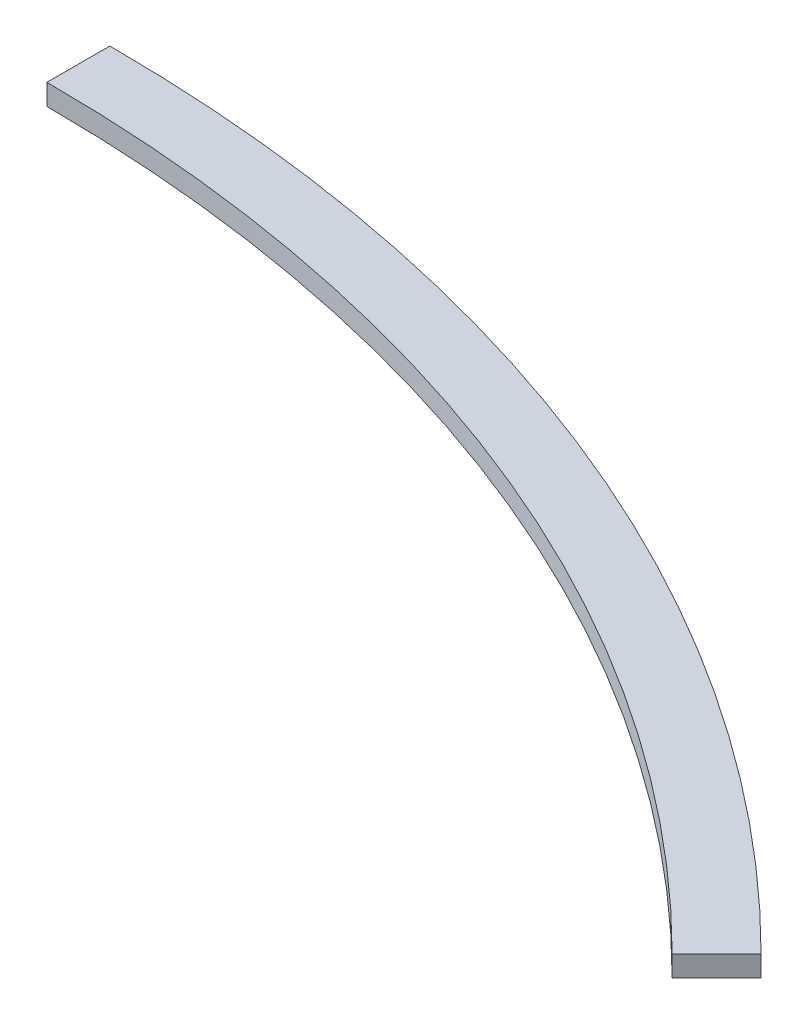
ISO-10303-21;
HEADER;
FILE_DESCRIPTION(('STEP AP214'),'2;1');
FILE_NAME('part.step','',(''),(''),'','','');
FILE_SCHEMA(('AUTOMOTIVE_DESIGN { 1 0 10303 214 1 1 1 1 }'));
ENDSEC;
DATA;
#1=APPLICATION_CONTEXT('core data for automotive mechanical design processes');
#2=APPLICATION_PROTOCOL_DEFINITION('international standard','automotive_design',2000,#1);
#3=PRODUCT_CONTEXT('',#1,'mechanical');
#4=PRODUCT('Part','Part','',(#3));
#5=PRODUCT_RELATED_PRODUCT_CATEGORY('part','',(#4));
#6=PRODUCT_DEFINITION_FORMATION('','',#4);
#7=PRODUCT_DEFINITION_CONTEXT('part definition',#1,'design');
#8=PRODUCT_DEFINITION('design','',#6,#7);
#9=PRODUCT_DEFINITION_SHAPE('','',#8);
#10=(LENGTH_UNIT() NAMED_UNIT(*) SI_UNIT(.MILLI.,.METRE.));
#11=(NAMED_UNIT(*) PLANE_ANGLE_UNIT() SI_UNIT($,.RADIAN.));
#12=(NAMED_UNIT(*) SI_UNIT($,.STERADIAN.) SOLID_ANGLE_UNIT());
#13=UNCERTAINTY_MEASURE_WITH_UNIT(LENGTH_MEASURE(1.E-05),#10,'distance_accuracy_value','');
#14=(GEOMETRIC_REPRESENTATION_CONTEXT(3) GLOBAL_UNCERTAINTY_ASSIGNED_CONTEXT((#13)) GLOBAL_UNIT_ASSIGNED_CONTEXT((#10,
#11,#12)) REPRESENTATION_CONTEXT('',''));
#15=CARTESIAN_POINT('',(0.,0.,0.));
#16=DIRECTION('',(0.,0.,1.));
#17=DIRECTION('',(1.,0.,0.));
#18=AXIS2_PLACEMENT_3D('',#15,#16,#17);
#19=CARTESIAN_POINT('',(0.,10.,0.));
#20=DIRECTION('',(0.,-1.,0.));
#21=DIRECTION('',(0.,0.,-1.));
#22=AXIS2_PLACEMENT_3D('',#19,#20,#21);
#23=CYLINDRICAL_SURFACE('',#22,720.);
#24=CARTESIAN_POINT('',(0.,0.,0.));
#25=DIRECTION('',(0.,-1.,0.));
#26=DIRECTION('',(0.,0.,-1.));
#27=AXIS2_PLACEMENT_3D('',#24,#25,#26);
#28=CIRCLE('',#27,720.);
#29=CARTESIAN_POINT('',(0.,0.,-720.));
#30=VERTEX_POINT('',#29);
#31=CARTESIAN_POINT('',(509.116882454315,0.,-509.116882454313));
#32=VERTEX_POINT('',#31);
#33=EDGE_CURVE('E97',#30,#32,#28,.T.);
#34=ORIENTED_EDGE('',*,*,#33,.T.);
#35=DIRECTION('',(0.,-1.,0.));
#36=VECTOR('',#35,1.);
#37=CARTESIAN_POINT('',(509.116882454315,10.,-509.116882454313));
#38=LINE('',#37,#36);
#39=CARTESIAN_POINT('',(509.116882454315,10.,-509.116882454313));
#40=VERTEX_POINT('',#39);
#41=EDGE_CURVE('E11',#40,#32,#38,.T.);
#42=ORIENTED_EDGE('',*,*,#41,.F.);
#43=CARTESIAN_POINT('',(0.,10.,0.));
#44=DIRECTION('',(0.,-1.,0.));
#45=DIRECTION('',(0.,0.,-1.));
#46=AXIS2_PLACEMENT_3D('',#43,#44,#45);
#47=CIRCLE('',#46,720.);
#48=CARTESIAN_POINT('',(0.,10.,-720.));
#49=VERTEX_POINT('',#48);
#50=EDGE_CURVE('E85',#49,#40,#47,.T.);
#51=ORIENTED_EDGE('',*,*,#50,.F.);
#52=DIRECTION('',(0.,-1.,0.));
#53=VECTOR('',#52,1.);
#54=CARTESIAN_POINT('',(0.,10.,-720.));
#55=LINE('',#54,#53);
#56=EDGE_CURVE('E93',#49,#30,#55,.T.);
#57=ORIENTED_EDGE('',*,*,#56,.T.);
#58=EDGE_LOOP('',(#34,#42,#51,#57));
#59=FACE_BOUND('',#58,.T.);
#60=ADVANCED_FACE('F34',(#59),#23,.F.);
#61=CARTESIAN_POINT('',(509.116882454315,10.,-509.116882454313));
#62=DIRECTION('',(-0.707106781186548,0.,-0.707106781186548));
#63=DIRECTION('',(-0.707106781186548,0.,0.707106781186548));
#64=AXIS2_PLACEMENT_3D('',#61,#62,#63);
#65=PLANE('',#64);
#66=DIRECTION('',(0.707106781186548,0.,-0.707106781186548));
#67=VECTOR('',#66,1.);
#68=CARTESIAN_POINT('',(509.116882454315,0.,-509.116882454313));
#69=LINE('',#68,#67);
#70=CARTESIAN_POINT('',(530.330085889912,0.,-530.33008588991));
#71=VERTEX_POINT('',#70);
#72=EDGE_CURVE('E89',#32,#71,#69,.T.);
#73=ORIENTED_EDGE('',*,*,#72,.T.);
#74=DIRECTION('',(0.,-1.,0.));
#75=VECTOR('',#74,1.);
#76=CARTESIAN_POINT('',(530.330085889912,10.,-530.33008588991));
#77=LINE('',#76,#75);
#78=CARTESIAN_POINT('',(530.330085889912,10.,-530.33008588991));
#79=VERTEX_POINT('',#78);
#80=EDGE_CURVE('E42',#79,#71,#77,.T.);
#81=ORIENTED_EDGE('',*,*,#80,.F.);
#82=DIRECTION('',(0.707106781186548,0.,-0.707106781186548));
#83=VECTOR('',#82,1.);
#84=CARTESIAN_POINT('',(509.116882454315,10.,-509.116882454313));
#85=LINE('',#84,#83);
#86=EDGE_CURVE('E80',#40,#79,#85,.T.);
#87=ORIENTED_EDGE('',*,*,#86,.F.);
#88=ORIENTED_EDGE('',*,*,#41,.T.);
#89=EDGE_LOOP('',(#73,#81,#87,#88));
#90=FACE_BOUND('',#89,.T.);
#91=ADVANCED_FACE('F88',(#90),#65,.F.);
#92=CARTESIAN_POINT('',(0.,10.,0.));
#93=DIRECTION('',(0.,-1.,0.));
#94=DIRECTION('',(0.,0.,-1.));
#95=AXIS2_PLACEMENT_3D('',#92,#93,#94);
#96=CYLINDRICAL_SURFACE('',#95,750.);
#97=CARTESIAN_POINT('',(0.,0.,0.));
#98=DIRECTION('',(0.,1.,0.));
#99=DIRECTION('',(0.,0.,-1.));
#100=AXIS2_PLACEMENT_3D('',#97,#98,#99);
#101=CIRCLE('',#100,750.);
#102=CARTESIAN_POINT('',(0.,0.,-750.));
#103=VERTEX_POINT('',#102);
#104=EDGE_CURVE('E67',#71,#103,#101,.T.);
#105=ORIENTED_EDGE('',*,*,#104,.T.);
#106=DIRECTION('',(0.,-1.,0.));
#107=VECTOR('',#106,1.);
#108=CARTESIAN_POINT('',(0.,10.,-750.));
#109=LINE('',#108,#107);
#110=CARTESIAN_POINT('',(0.,10.,-750.));
#111=VERTEX_POINT('',#110);
#112=EDGE_CURVE('E90',#111,#103,#109,.T.);
#113=ORIENTED_EDGE('',*,*,#112,.F.);
#114=CARTESIAN_POINT('',(0.,10.,0.));
#115=DIRECTION('',(0.,1.,0.));
#116=DIRECTION('',(0.,0.,-1.));
#117=AXIS2_PLACEMENT_3D('',#114,#115,#116);
#118=CIRCLE('',#117,750.);
#119=EDGE_CURVE('E83',#79,#111,#118,.T.);
#120=ORIENTED_EDGE('',*,*,#119,.F.);
#121=ORIENTED_EDGE('',*,*,#80,.T.);
#122=EDGE_LOOP('',(#105,#113,#120,#121));
#123=FACE_BOUND('',#122,.T.);
#124=ADVANCED_FACE('F91',(#123),#96,.T.);
#125=CARTESIAN_POINT('',(0.,10.,-720.));
#126=DIRECTION('',(1.,0.,0.));
#127=DIRECTION('',(0.,0.,-1.));
#128=AXIS2_PLACEMENT_3D('',#125,#126,#127);
#129=PLANE('',#128);
#130=DIRECTION('',(0.,0.,1.));
#131=VECTOR('',#130,1.);
#132=CARTESIAN_POINT('',(0.,0.,-720.));
#133=LINE('',#132,#131);
#134=EDGE_CURVE('E73',#103,#30,#133,.T.);
#135=ORIENTED_EDGE('',*,*,#134,.T.);
#136=ORIENTED_EDGE('',*,*,#56,.F.);
#137=DIRECTION('',(0.,0.,1.));
#138=VECTOR('',#137,1.);
#139=CARTESIAN_POINT('',(0.,10.,-720.));
#140=LINE('',#139,#138);
#141=EDGE_CURVE('E50',#111,#49,#140,.T.);
#142=ORIENTED_EDGE('',*,*,#141,.F.);
#143=ORIENTED_EDGE('',*,*,#112,.T.);
#144=EDGE_LOOP('',(#135,#136,#142,#143));
#145=FACE_BOUND('',#144,.T.);
#146=ADVANCED_FACE('F104',(#145),#129,.F.);
#147=CARTESIAN_POINT('',(0.,10.,0.));
#148=DIRECTION('',(0.,-1.,0.));
#149=DIRECTION('',(0.,0.,-1.));
#150=AXIS2_PLACEMENT_3D('',#147,#148,#149);
#151=PLANE('',#150);
#152=ORIENTED_EDGE('',*,*,#50,.T.);
#153=ORIENTED_EDGE('',*,*,#86,.T.);
#154=ORIENTED_EDGE('',*,*,#119,.T.);
#155=ORIENTED_EDGE('',*,*,#141,.T.);
#156=EDGE_LOOP('',(#152,#153,#154,#155));
#157=FACE_BOUND('',#156,.T.);
#158=ADVANCED_FACE('F81',(#157),#151,.F.);
#159=CARTESIAN_POINT('',(0.,0.,0.));
#160=DIRECTION('',(0.,-1.,0.));
#161=DIRECTION('',(0.,0.,-1.));
#162=AXIS2_PLACEMENT_3D('',#159,#160,#161);
#163=PLANE('',#162);
#164=ORIENTED_EDGE('',*,*,#33,.F.);
#165=ORIENTED_EDGE('',*,*,#134,.F.);
#166=ORIENTED_EDGE('',*,*,#104,.F.);
#167=ORIENTED_EDGE('',*,*,#72,.F.);
#168=EDGE_LOOP('',(#164,#165,#166,#167));
#169=FACE_BOUND('',#168,.T.);
#170=ADVANCED_FACE('F107',(#169),#163,.T.);
#171=CLOSED_SHELL('',(#60,#91,#124,#146,#158,#170));
#172=MANIFOLD_SOLID_BREP('B2',#171);
#173=ADVANCED_BREP_SHAPE_REPRESENTATION('',(#18,#172),#14);
#174=SHAPE_DEFINITION_REPRESENTATION(#9,#173);
ENDSEC;
END-ISO-10303-21;
